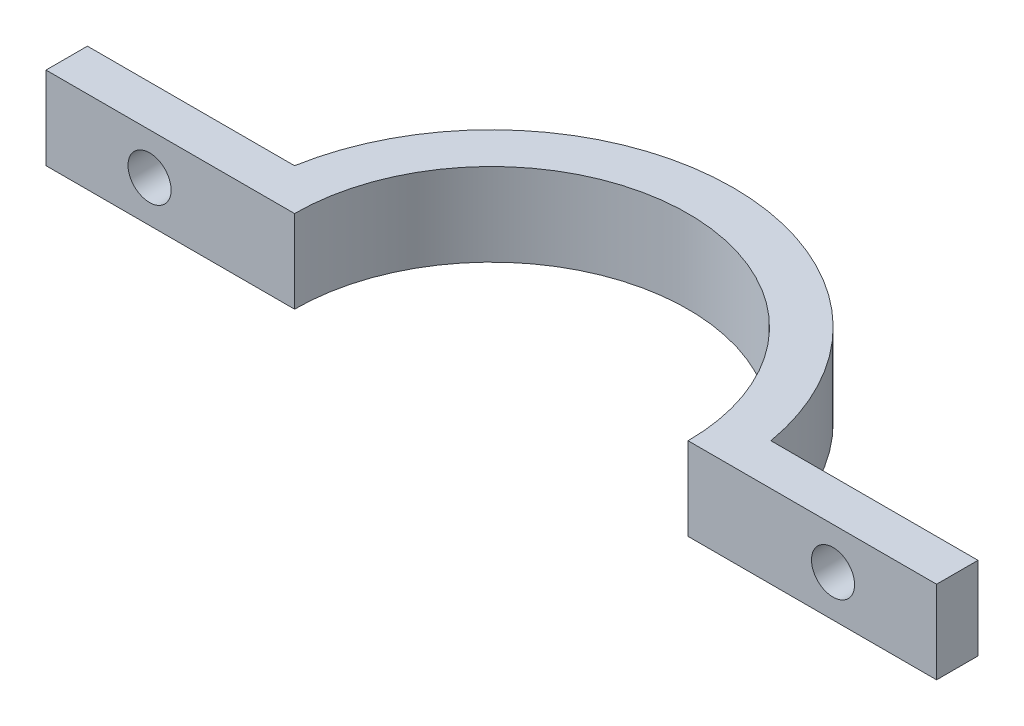
ISO-10303-21;
HEADER;
FILE_DESCRIPTION(('STEP AP214'),'2;1');
FILE_NAME('part.step','',(''),(''),'','','');
FILE_SCHEMA(('AUTOMOTIVE_DESIGN { 1 0 10303 214 1 1 1 1 }'));
ENDSEC;
DATA;
#1=APPLICATION_CONTEXT('core data for automotive mechanical design processes');
#2=APPLICATION_PROTOCOL_DEFINITION('international standard','automotive_design',2000,#1);
#3=PRODUCT_CONTEXT('',#1,'mechanical');
#4=PRODUCT('Part','Part','',(#3));
#5=PRODUCT_RELATED_PRODUCT_CATEGORY('part','',(#4));
#6=PRODUCT_DEFINITION_FORMATION('','',#4);
#7=PRODUCT_DEFINITION_CONTEXT('part definition',#1,'design');
#8=PRODUCT_DEFINITION('design','',#6,#7);
#9=PRODUCT_DEFINITION_SHAPE('','',#8);
#10=(LENGTH_UNIT() NAMED_UNIT(*) SI_UNIT(.MILLI.,.METRE.));
#11=(NAMED_UNIT(*) PLANE_ANGLE_UNIT() SI_UNIT($,.RADIAN.));
#12=(NAMED_UNIT(*) SI_UNIT($,.STERADIAN.) SOLID_ANGLE_UNIT());
#13=UNCERTAINTY_MEASURE_WITH_UNIT(LENGTH_MEASURE(1.E-05),#10,'distance_accuracy_value','');
#14=(GEOMETRIC_REPRESENTATION_CONTEXT(3) GLOBAL_UNCERTAINTY_ASSIGNED_CONTEXT((#13)) GLOBAL_UNIT_ASSIGNED_CONTEXT((#10,
#11,#12)) REPRESENTATION_CONTEXT('',''));
#15=CARTESIAN_POINT('',(0.,0.,0.));
#16=DIRECTION('',(0.,0.,1.));
#17=DIRECTION('',(1.,0.,0.));
#18=AXIS2_PLACEMENT_3D('',#15,#16,#17);
#19=CARTESIAN_POINT('',(0.,6.35,0.));
#20=DIRECTION('',(0.,-1.,0.));
#21=DIRECTION('',(0.,0.,-1.));
#22=AXIS2_PLACEMENT_3D('',#19,#20,#21);
#23=CYLINDRICAL_SURFACE('',#22,15.08125);
#24=CARTESIAN_POINT('',(0.,0.,0.));
#25=DIRECTION('',(0.,-1.,0.));
#26=DIRECTION('',(0.,0.,-1.));
#27=AXIS2_PLACEMENT_3D('',#24,#25,#26);
#28=CIRCLE('',#27,15.08125);
#29=CARTESIAN_POINT('',(-15.08125,0.,0.));
#30=VERTEX_POINT('',#29);
#31=CARTESIAN_POINT('',(15.08125,0.,0.));
#32=VERTEX_POINT('',#31);
#33=EDGE_CURVE('E141',#30,#32,#28,.T.);
#34=ORIENTED_EDGE('',*,*,#33,.T.);
#35=DIRECTION('',(0.,-1.,0.));
#36=VECTOR('',#35,1.);
#37=CARTESIAN_POINT('',(15.08125,6.35,0.));
#38=LINE('',#37,#36);
#39=CARTESIAN_POINT('',(15.08125,6.35,0.));
#40=VERTEX_POINT('',#39);
#41=EDGE_CURVE('E11',#40,#32,#38,.T.);
#42=ORIENTED_EDGE('',*,*,#41,.F.);
#43=CARTESIAN_POINT('',(0.,6.35,0.));
#44=DIRECTION('',(0.,-1.,0.));
#45=DIRECTION('',(0.,0.,-1.));
#46=AXIS2_PLACEMENT_3D('',#43,#44,#45);
#47=CIRCLE('',#46,15.08125);
#48=CARTESIAN_POINT('',(-15.08125,6.35,0.));
#49=VERTEX_POINT('',#48);
#50=EDGE_CURVE('E163',#49,#40,#47,.T.);
#51=ORIENTED_EDGE('',*,*,#50,.F.);
#52=DIRECTION('',(0.,-1.,0.));
#53=VECTOR('',#52,1.);
#54=CARTESIAN_POINT('',(-15.08125,6.35,0.));
#55=LINE('',#54,#53);
#56=EDGE_CURVE('E137',#49,#30,#55,.T.);
#57=ORIENTED_EDGE('',*,*,#56,.T.);
#58=EDGE_LOOP('',(#34,#42,#51,#57));
#59=FACE_BOUND('',#58,.T.);
#60=ADVANCED_FACE('F39',(#59),#23,.F.);
#61=CARTESIAN_POINT('',(15.08125,6.35,0.));
#62=DIRECTION('',(0.,0.,-1.));
#63=DIRECTION('',(-1.,0.,0.));
#64=AXIS2_PLACEMENT_3D('',#61,#62,#63);
#65=PLANE('',#64);
#66=CARTESIAN_POINT('',(26.19375,3.175,0.));
#67=DIRECTION('',(0.,0.,-1.));
#68=DIRECTION('',(-1.,0.,0.));
#69=AXIS2_PLACEMENT_3D('',#66,#67,#68);
#70=CIRCLE('',#69,1.651);
#71=CARTESIAN_POINT('',(24.54275,3.175,0.));
#72=VERTEX_POINT('',#71);
#73=EDGE_CURVE('E212',#72,#72,#70,.F.);
#74=ORIENTED_EDGE('',*,*,#73,.F.);
#75=EDGE_LOOP('',(#74));
#76=FACE_BOUND('',#75,.T.);
#77=DIRECTION('',(1.,0.,0.));
#78=VECTOR('',#77,1.);
#79=CARTESIAN_POINT('',(15.08125,0.,0.));
#80=LINE('',#79,#78);
#81=CARTESIAN_POINT('',(34.13125,0.,0.));
#82=VERTEX_POINT('',#81);
#83=EDGE_CURVE('E145',#32,#82,#80,.T.);
#84=ORIENTED_EDGE('',*,*,#83,.T.);
#85=DIRECTION('',(0.,-1.,0.));
#86=VECTOR('',#85,1.);
#87=CARTESIAN_POINT('',(34.13125,6.35,0.));
#88=LINE('',#87,#86);
#89=CARTESIAN_POINT('',(34.13125,6.35,0.));
#90=VERTEX_POINT('',#89);
#91=EDGE_CURVE('E49',#90,#82,#88,.T.);
#92=ORIENTED_EDGE('',*,*,#91,.F.);
#93=DIRECTION('',(1.,0.,0.));
#94=VECTOR('',#93,1.);
#95=CARTESIAN_POINT('',(15.08125,6.35,0.));
#96=LINE('',#95,#94);
#97=EDGE_CURVE('E100',#40,#90,#96,.T.);
#98=ORIENTED_EDGE('',*,*,#97,.F.);
#99=ORIENTED_EDGE('',*,*,#41,.T.);
#100=EDGE_LOOP('',(#84,#92,#98,#99));
#101=FACE_BOUND('',#100,.T.);
#102=ADVANCED_FACE('F229',(#76,#101),#65,.F.);
#103=CARTESIAN_POINT('',(34.13125,6.35,0.));
#104=DIRECTION('',(-1.,0.,0.));
#105=DIRECTION('',(0.,0.,1.));
#106=AXIS2_PLACEMENT_3D('',#103,#104,#105);
#107=PLANE('',#106);
#108=DIRECTION('',(0.,0.,-1.));
#109=VECTOR('',#108,1.);
#110=CARTESIAN_POINT('',(34.13125,0.,0.));
#111=LINE('',#110,#109);
#112=CARTESIAN_POINT('',(34.13125,0.,-3.175));
#113=VERTEX_POINT('',#112);
#114=EDGE_CURVE('E148',#82,#113,#111,.T.);
#115=ORIENTED_EDGE('',*,*,#114,.T.);
#116=DIRECTION('',(0.,-1.,0.));
#117=VECTOR('',#116,1.);
#118=CARTESIAN_POINT('',(34.13125,6.35,-3.175));
#119=LINE('',#118,#117);
#120=CARTESIAN_POINT('',(34.13125,6.35,-3.175));
#121=VERTEX_POINT('',#120);
#122=EDGE_CURVE('E174',#121,#113,#119,.T.);
#123=ORIENTED_EDGE('',*,*,#122,.F.);
#124=DIRECTION('',(0.,0.,-1.));
#125=VECTOR('',#124,1.);
#126=CARTESIAN_POINT('',(34.13125,6.35,0.));
#127=LINE('',#126,#125);
#128=EDGE_CURVE('E185',#90,#121,#127,.T.);
#129=ORIENTED_EDGE('',*,*,#128,.F.);
#130=ORIENTED_EDGE('',*,*,#91,.T.);
#131=EDGE_LOOP('',(#115,#123,#129,#130));
#132=FACE_BOUND('',#131,.T.);
#133=ADVANCED_FACE('F183',(#132),#107,.F.);
#134=CARTESIAN_POINT('',(34.13125,6.35,-3.175));
#135=DIRECTION('',(0.,0.,1.));
#136=DIRECTION('',(1.,0.,0.));
#137=AXIS2_PLACEMENT_3D('',#134,#135,#136);
#138=PLANE('',#137);
#139=CARTESIAN_POINT('',(26.19375,3.175,-3.175));
#140=DIRECTION('',(0.,0.,1.));
#141=DIRECTION('',(1.,0.,0.));
#142=AXIS2_PLACEMENT_3D('',#139,#140,#141);
#143=CIRCLE('',#142,1.651);
#144=CARTESIAN_POINT('',(27.84475,3.175,-3.175));
#145=VERTEX_POINT('',#144);
#146=EDGE_CURVE('E216',#145,#145,#143,.T.);
#147=ORIENTED_EDGE('',*,*,#146,.T.);
#148=EDGE_LOOP('',(#147));
#149=FACE_BOUND('',#148,.T.);
#150=DIRECTION('',(-1.,0.,0.));
#151=VECTOR('',#150,1.);
#152=CARTESIAN_POINT('',(34.13125,0.,-3.175));
#153=LINE('',#152,#151);
#154=CARTESIAN_POINT('',(18.25625,0.,-3.17499999999999));
#155=VERTEX_POINT('',#154);
#156=EDGE_CURVE('E151',#113,#155,#153,.T.);
#157=ORIENTED_EDGE('',*,*,#156,.T.);
#158=DIRECTION('',(0.,-1.,0.));
#159=VECTOR('',#158,1.);
#160=CARTESIAN_POINT('',(18.25625,6.35,-3.17499999999999));
#161=LINE('',#160,#159);
#162=CARTESIAN_POINT('',(18.25625,6.35,-3.17499999999999));
#163=VERTEX_POINT('',#162);
#164=EDGE_CURVE('E170',#163,#155,#161,.T.);
#165=ORIENTED_EDGE('',*,*,#164,.F.);
#166=DIRECTION('',(-1.,0.,0.));
#167=VECTOR('',#166,1.);
#168=CARTESIAN_POINT('',(34.13125,6.35,-3.175));
#169=LINE('',#168,#167);
#170=EDGE_CURVE('E198',#121,#163,#169,.T.);
#171=ORIENTED_EDGE('',*,*,#170,.F.);
#172=ORIENTED_EDGE('',*,*,#122,.T.);
#173=EDGE_LOOP('',(#157,#165,#171,#172));
#174=FACE_BOUND('',#173,.T.);
#175=ADVANCED_FACE('F193',(#149,#174),#138,.F.);
#176=CARTESIAN_POINT('',(0.,6.35,0.));
#177=DIRECTION('',(0.,-1.,0.));
#178=DIRECTION('',(0.,0.,-1.));
#179=AXIS2_PLACEMENT_3D('',#176,#177,#178);
#180=CYLINDRICAL_SURFACE('',#179,18.5302803287619);
#181=CARTESIAN_POINT('',(0.,0.,0.));
#182=DIRECTION('',(0.,1.,0.));
#183=DIRECTION('',(0.,0.,-1.));
#184=AXIS2_PLACEMENT_3D('',#181,#182,#183);
#185=CIRCLE('',#184,18.5302803287619);
#186=CARTESIAN_POINT('',(-18.25625,0.,-3.175));
#187=VERTEX_POINT('',#186);
#188=EDGE_CURVE('E154',#155,#187,#185,.T.);
#189=ORIENTED_EDGE('',*,*,#188,.T.);
#190=DIRECTION('',(0.,-1.,0.));
#191=VECTOR('',#190,1.);
#192=CARTESIAN_POINT('',(-18.25625,6.35,-3.175));
#193=LINE('',#192,#191);
#194=CARTESIAN_POINT('',(-18.25625,6.35,-3.175));
#195=VERTEX_POINT('',#194);
#196=EDGE_CURVE('E130',#195,#187,#193,.T.);
#197=ORIENTED_EDGE('',*,*,#196,.F.);
#198=CARTESIAN_POINT('',(0.,6.35,0.));
#199=DIRECTION('',(0.,1.,0.));
#200=DIRECTION('',(0.,0.,-1.));
#201=AXIS2_PLACEMENT_3D('',#198,#199,#200);
#202=CIRCLE('',#201,18.5302803287619);
#203=EDGE_CURVE('E119',#163,#195,#202,.T.);
#204=ORIENTED_EDGE('',*,*,#203,.F.);
#205=ORIENTED_EDGE('',*,*,#164,.T.);
#206=EDGE_LOOP('',(#189,#197,#204,#205));
#207=FACE_BOUND('',#206,.T.);
#208=ADVANCED_FACE('F196',(#207),#180,.T.);
#209=CARTESIAN_POINT('',(-34.13125,6.35,-3.175));
#210=DIRECTION('',(0.,0.,1.));
#211=DIRECTION('',(1.,0.,0.));
#212=AXIS2_PLACEMENT_3D('',#209,#210,#211);
#213=PLANE('',#212);
#214=CARTESIAN_POINT('',(-26.19375,3.175,-3.175));
#215=DIRECTION('',(0.,0.,-1.));
#216=DIRECTION('',(-1.,0.,0.));
#217=AXIS2_PLACEMENT_3D('',#214,#215,#216);
#218=CIRCLE('',#217,1.651);
#219=CARTESIAN_POINT('',(-27.84475,3.175,-3.175));
#220=VERTEX_POINT('',#219);
#221=EDGE_CURVE('E208',#220,#220,#218,.T.);
#222=ORIENTED_EDGE('',*,*,#221,.F.);
#223=EDGE_LOOP('',(#222));
#224=FACE_BOUND('',#223,.T.);
#225=DIRECTION('',(-1.,0.,0.));
#226=VECTOR('',#225,1.);
#227=CARTESIAN_POINT('',(-34.13125,0.,-3.175));
#228=LINE('',#227,#226);
#229=CARTESIAN_POINT('',(-34.13125,0.,-3.175));
#230=VERTEX_POINT('',#229);
#231=EDGE_CURVE('E128',#187,#230,#228,.T.);
#232=ORIENTED_EDGE('',*,*,#231,.T.);
#233=DIRECTION('',(0.,-1.,0.));
#234=VECTOR('',#233,1.);
#235=CARTESIAN_POINT('',(-34.13125,6.35,-3.175));
#236=LINE('',#235,#234);
#237=CARTESIAN_POINT('',(-34.13125,6.35,-3.175));
#238=VERTEX_POINT('',#237);
#239=EDGE_CURVE('E125',#238,#230,#236,.T.);
#240=ORIENTED_EDGE('',*,*,#239,.F.);
#241=DIRECTION('',(-1.,0.,0.));
#242=VECTOR('',#241,1.);
#243=CARTESIAN_POINT('',(-34.13125,6.35,-3.175));
#244=LINE('',#243,#242);
#245=EDGE_CURVE('E113',#195,#238,#244,.T.);
#246=ORIENTED_EDGE('',*,*,#245,.F.);
#247=ORIENTED_EDGE('',*,*,#196,.T.);
#248=EDGE_LOOP('',(#232,#240,#246,#247));
#249=FACE_BOUND('',#248,.T.);
#250=ADVANCED_FACE('F126',(#224,#249),#213,.F.);
#251=CARTESIAN_POINT('',(-34.13125,6.35,0.));
#252=DIRECTION('',(1.,0.,0.));
#253=DIRECTION('',(0.,0.,-1.));
#254=AXIS2_PLACEMENT_3D('',#251,#252,#253);
#255=PLANE('',#254);
#256=DIRECTION('',(0.,0.,1.));
#257=VECTOR('',#256,1.);
#258=CARTESIAN_POINT('',(-34.13125,0.,0.));
#259=LINE('',#258,#257);
#260=CARTESIAN_POINT('',(-34.13125,0.,0.));
#261=VERTEX_POINT('',#260);
#262=EDGE_CURVE('E86',#230,#261,#259,.T.);
#263=ORIENTED_EDGE('',*,*,#262,.T.);
#264=DIRECTION('',(0.,-1.,0.));
#265=VECTOR('',#264,1.);
#266=CARTESIAN_POINT('',(-34.13125,6.35,0.));
#267=LINE('',#266,#265);
#268=CARTESIAN_POINT('',(-34.13125,6.35,0.));
#269=VERTEX_POINT('',#268);
#270=EDGE_CURVE('E131',#269,#261,#267,.T.);
#271=ORIENTED_EDGE('',*,*,#270,.F.);
#272=DIRECTION('',(0.,0.,1.));
#273=VECTOR('',#272,1.);
#274=CARTESIAN_POINT('',(-34.13125,6.35,0.));
#275=LINE('',#274,#273);
#276=EDGE_CURVE('E117',#238,#269,#275,.T.);
#277=ORIENTED_EDGE('',*,*,#276,.F.);
#278=ORIENTED_EDGE('',*,*,#239,.T.);
#279=EDGE_LOOP('',(#263,#271,#277,#278));
#280=FACE_BOUND('',#279,.T.);
#281=ADVANCED_FACE('F133',(#280),#255,.F.);
#282=CARTESIAN_POINT('',(-15.08125,6.35,0.));
#283=DIRECTION('',(0.,0.,-1.));
#284=DIRECTION('',(-1.,0.,0.));
#285=AXIS2_PLACEMENT_3D('',#282,#283,#284);
#286=PLANE('',#285);
#287=CARTESIAN_POINT('',(-26.19375,3.175,0.));
#288=DIRECTION('',(0.,0.,-1.));
#289=DIRECTION('',(-1.,0.,0.));
#290=AXIS2_PLACEMENT_3D('',#287,#288,#289);
#291=CIRCLE('',#290,1.651);
#292=CARTESIAN_POINT('',(-27.84475,3.175,0.));
#293=VERTEX_POINT('',#292);
#294=EDGE_CURVE('E42',#293,#293,#291,.T.);
#295=ORIENTED_EDGE('',*,*,#294,.T.);
#296=EDGE_LOOP('',(#295));
#297=FACE_BOUND('',#296,.T.);
#298=DIRECTION('',(1.,0.,0.));
#299=VECTOR('',#298,1.);
#300=CARTESIAN_POINT('',(-15.08125,0.,0.));
#301=LINE('',#300,#299);
#302=EDGE_CURVE('E92',#261,#30,#301,.T.);
#303=ORIENTED_EDGE('',*,*,#302,.T.);
#304=ORIENTED_EDGE('',*,*,#56,.F.);
#305=DIRECTION('',(1.,0.,0.));
#306=VECTOR('',#305,1.);
#307=CARTESIAN_POINT('',(-15.08125,6.35,0.));
#308=LINE('',#307,#306);
#309=EDGE_CURVE('E57',#269,#49,#308,.T.);
#310=ORIENTED_EDGE('',*,*,#309,.F.);
#311=ORIENTED_EDGE('',*,*,#270,.T.);
#312=EDGE_LOOP('',(#303,#304,#310,#311));
#313=FACE_BOUND('',#312,.T.);
#314=ADVANCED_FACE('F234',(#297,#313),#286,.F.);
#315=CARTESIAN_POINT('',(0.,6.35,0.));
#316=DIRECTION('',(0.,-1.,0.));
#317=DIRECTION('',(0.,0.,-1.));
#318=AXIS2_PLACEMENT_3D('',#315,#316,#317);
#319=PLANE('',#318);
#320=ORIENTED_EDGE('',*,*,#50,.T.);
#321=ORIENTED_EDGE('',*,*,#97,.T.);
#322=ORIENTED_EDGE('',*,*,#128,.T.);
#323=ORIENTED_EDGE('',*,*,#170,.T.);
#324=ORIENTED_EDGE('',*,*,#203,.T.);
#325=ORIENTED_EDGE('',*,*,#245,.T.);
#326=ORIENTED_EDGE('',*,*,#276,.T.);
#327=ORIENTED_EDGE('',*,*,#309,.T.);
#328=EDGE_LOOP('',(#320,#321,#322,#323,#324,#325,#326,#327));
#329=FACE_BOUND('',#328,.T.);
#330=ADVANCED_FACE('F115',(#329),#319,.F.);
#331=CARTESIAN_POINT('',(0.,0.,0.));
#332=DIRECTION('',(0.,-1.,0.));
#333=DIRECTION('',(0.,0.,-1.));
#334=AXIS2_PLACEMENT_3D('',#331,#332,#333);
#335=PLANE('',#334);
#336=ORIENTED_EDGE('',*,*,#33,.F.);
#337=ORIENTED_EDGE('',*,*,#302,.F.);
#338=ORIENTED_EDGE('',*,*,#262,.F.);
#339=ORIENTED_EDGE('',*,*,#231,.F.);
#340=ORIENTED_EDGE('',*,*,#188,.F.);
#341=ORIENTED_EDGE('',*,*,#156,.F.);
#342=ORIENTED_EDGE('',*,*,#114,.F.);
#343=ORIENTED_EDGE('',*,*,#83,.F.);
#344=EDGE_LOOP('',(#336,#337,#338,#339,#340,#341,#342,#343));
#345=FACE_BOUND('',#344,.T.);
#346=ADVANCED_FACE('F189',(#345),#335,.T.);
#347=CARTESIAN_POINT('',(-26.19375,3.175,3.175));
#348=DIRECTION('',(0.,0.,-1.));
#349=DIRECTION('',(-1.,0.,0.));
#350=AXIS2_PLACEMENT_3D('',#347,#348,#349);
#351=CYLINDRICAL_SURFACE('',#350,1.651);
#352=ORIENTED_EDGE('',*,*,#221,.T.);
#353=EDGE_LOOP('',(#352));
#354=FACE_BOUND('',#353,.T.);
#355=ORIENTED_EDGE('',*,*,#294,.F.);
#356=EDGE_LOOP('',(#355));
#357=FACE_BOUND('',#356,.T.);
#358=ADVANCED_FACE('F225',(#354,#357),#351,.F.);
#359=CARTESIAN_POINT('',(26.19375,3.175,3.175));
#360=DIRECTION('',(0.,0.,-1.));
#361=DIRECTION('',(-1.,0.,0.));
#362=AXIS2_PLACEMENT_3D('',#359,#360,#361);
#363=CYLINDRICAL_SURFACE('',#362,1.651);
#364=ORIENTED_EDGE('',*,*,#146,.F.);
#365=EDGE_LOOP('',(#364));
#366=FACE_BOUND('',#365,.T.);
#367=ORIENTED_EDGE('',*,*,#73,.T.);
#368=EDGE_LOOP('',(#367));
#369=FACE_BOUND('',#368,.T.);
#370=ADVANCED_FACE('F222',(#366,#369),#363,.F.);
#371=CLOSED_SHELL('',(#60,#102,#133,#175,#208,#250,#281,#314,#330,#346,#358,#370));
#372=MANIFOLD_SOLID_BREP('B2',#371);
#373=ADVANCED_BREP_SHAPE_REPRESENTATION('',(#18,#372),#14);
#374=SHAPE_DEFINITION_REPRESENTATION(#9,#373);
ENDSEC;
END-ISO-10303-21;
